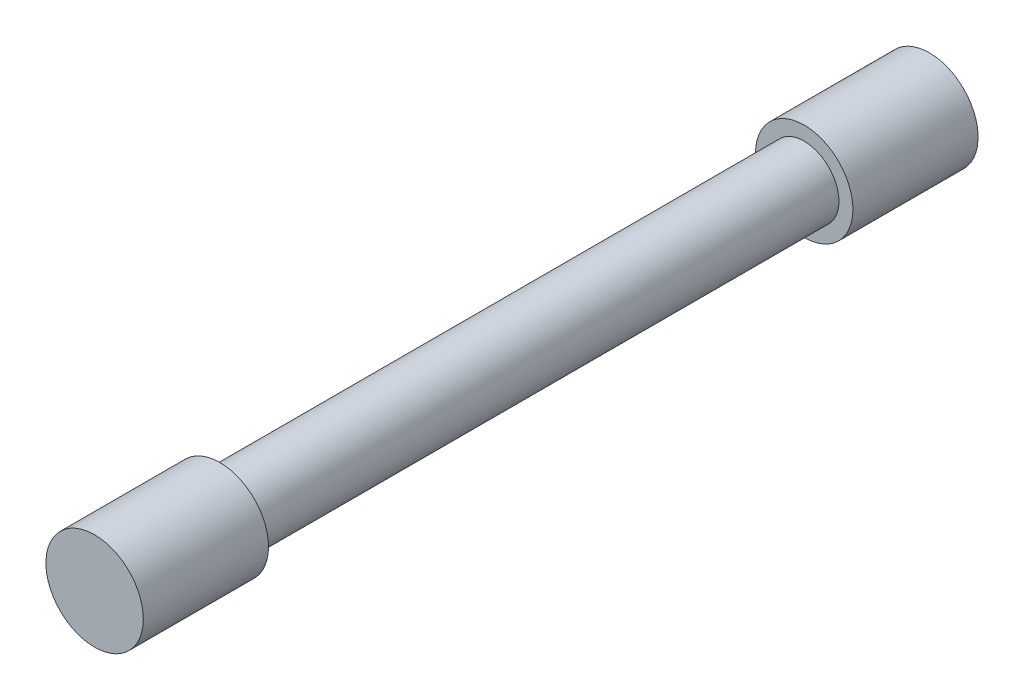
ISO-10303-21;
HEADER;
FILE_DESCRIPTION(('STEP AP214'),'2;1');
FILE_NAME('part.step','',(''),(''),'','','');
FILE_SCHEMA(('AUTOMOTIVE_DESIGN { 1 0 10303 214 1 1 1 1 }'));
ENDSEC;
DATA;
#1=APPLICATION_CONTEXT('core data for automotive mechanical design processes');
#2=APPLICATION_PROTOCOL_DEFINITION('international standard','automotive_design',2000,#1);
#3=PRODUCT_CONTEXT('',#1,'mechanical');
#4=PRODUCT('Part','Part','',(#3));
#5=PRODUCT_RELATED_PRODUCT_CATEGORY('part','',(#4));
#6=PRODUCT_DEFINITION_FORMATION('','',#4);
#7=PRODUCT_DEFINITION_CONTEXT('part definition',#1,'design');
#8=PRODUCT_DEFINITION('design','',#6,#7);
#9=PRODUCT_DEFINITION_SHAPE('','',#8);
#10=(LENGTH_UNIT() NAMED_UNIT(*) SI_UNIT(.MILLI.,.METRE.));
#11=(NAMED_UNIT(*) PLANE_ANGLE_UNIT() SI_UNIT($,.RADIAN.));
#12=(NAMED_UNIT(*) SI_UNIT($,.STERADIAN.) SOLID_ANGLE_UNIT());
#13=UNCERTAINTY_MEASURE_WITH_UNIT(LENGTH_MEASURE(1.E-05),#10,'distance_accuracy_value','');
#14=(GEOMETRIC_REPRESENTATION_CONTEXT(3) GLOBAL_UNCERTAINTY_ASSIGNED_CONTEXT((#13)) GLOBAL_UNIT_ASSIGNED_CONTEXT((#10,
#11,#12)) REPRESENTATION_CONTEXT('',''));
#15=CARTESIAN_POINT('',(0.,0.,0.));
#16=DIRECTION('',(0.,0.,1.));
#17=DIRECTION('',(1.,0.,0.));
#18=AXIS2_PLACEMENT_3D('',#15,#16,#17);
#19=CARTESIAN_POINT('',(0.,0.,18.));
#20=DIRECTION('',(0.,0.,-1.));
#21=DIRECTION('',(-1.,0.,0.));
#22=AXIS2_PLACEMENT_3D('',#19,#20,#21);
#23=CYLINDRICAL_SURFACE('',#22,7.);
#24=CARTESIAN_POINT('',(0.,0.,18.));
#25=DIRECTION('',(0.,0.,1.));
#26=DIRECTION('',(1.,0.,0.));
#27=AXIS2_PLACEMENT_3D('',#24,#25,#26);
#28=CIRCLE('',#27,7.);
#29=CARTESIAN_POINT('',(7.,0.,18.));
#30=VERTEX_POINT('',#29);
#31=EDGE_CURVE('E41',#30,#30,#28,.T.);
#32=ORIENTED_EDGE('',*,*,#31,.F.);
#33=EDGE_LOOP('',(#32));
#34=FACE_BOUND('',#33,.T.);
#35=CARTESIAN_POINT('',(0.,0.,0.));
#36=DIRECTION('',(0.,0.,1.));
#37=DIRECTION('',(1.,0.,0.));
#38=AXIS2_PLACEMENT_3D('',#35,#36,#37);
#39=CIRCLE('',#38,7.);
#40=CARTESIAN_POINT('',(7.,0.,0.));
#41=VERTEX_POINT('',#40);
#42=EDGE_CURVE('E45',#41,#41,#39,.T.);
#43=ORIENTED_EDGE('',*,*,#42,.T.);
#44=EDGE_LOOP('',(#43));
#45=FACE_BOUND('',#44,.T.);
#46=ADVANCED_FACE('F35',(#34,#45),#23,.T.);
#47=CARTESIAN_POINT('',(0.,0.,18.));
#48=DIRECTION('',(0.,0.,1.));
#49=DIRECTION('',(1.,0.,0.));
#50=AXIS2_PLACEMENT_3D('',#47,#48,#49);
#51=PLANE('',#50);
#52=ORIENTED_EDGE('',*,*,#31,.T.);
#53=EDGE_LOOP('',(#52));
#54=FACE_BOUND('',#53,.T.);
#55=ADVANCED_FACE('F79',(#54),#51,.T.);
#56=CARTESIAN_POINT('',(0.,0.,0.));
#57=DIRECTION('',(0.,0.,1.));
#58=DIRECTION('',(1.,0.,0.));
#59=AXIS2_PLACEMENT_3D('',#56,#57,#58);
#60=PLANE('',#59);
#61=CARTESIAN_POINT('',(0.,0.,0.));
#62=DIRECTION('',(0.,0.,1.));
#63=DIRECTION('',(1.,0.,0.));
#64=AXIS2_PLACEMENT_3D('',#61,#62,#63);
#65=CIRCLE('',#64,5.);
#66=CARTESIAN_POINT('',(5.,0.,0.));
#67=VERTEX_POINT('',#66);
#68=EDGE_CURVE('E10',#67,#67,#65,.F.);
#69=ORIENTED_EDGE('',*,*,#68,.F.);
#70=EDGE_LOOP('',(#69));
#71=FACE_BOUND('',#70,.T.);
#72=ORIENTED_EDGE('',*,*,#42,.F.);
#73=EDGE_LOOP('',(#72));
#74=FACE_BOUND('',#73,.T.);
#75=ADVANCED_FACE('F84',(#71,#74),#60,.F.);
#76=CARTESIAN_POINT('',(0.,0.,-84.));
#77=DIRECTION('',(0.,0.,1.));
#78=DIRECTION('',(1.,0.,0.));
#79=AXIS2_PLACEMENT_3D('',#76,#77,#78);
#80=CYLINDRICAL_SURFACE('',#79,5.);
#81=CARTESIAN_POINT('',(0.,0.,-84.));
#82=DIRECTION('',(0.,0.,-1.));
#83=DIRECTION('',(-1.,0.,0.));
#84=AXIS2_PLACEMENT_3D('',#81,#82,#83);
#85=CIRCLE('',#84,5.);
#86=CARTESIAN_POINT('',(-5.,0.,-84.));
#87=VERTEX_POINT('',#86);
#88=EDGE_CURVE('E50',#87,#87,#85,.T.);
#89=ORIENTED_EDGE('',*,*,#88,.F.);
#90=EDGE_LOOP('',(#89));
#91=FACE_BOUND('',#90,.T.);
#92=ORIENTED_EDGE('',*,*,#68,.T.);
#93=EDGE_LOOP('',(#92));
#94=FACE_BOUND('',#93,.T.);
#95=ADVANCED_FACE('F66',(#91,#94),#80,.T.);
#96=CARTESIAN_POINT('',(0.,0.,-102.));
#97=DIRECTION('',(0.,0.,1.));
#98=DIRECTION('',(1.,0.,0.));
#99=AXIS2_PLACEMENT_3D('',#96,#97,#98);
#100=CYLINDRICAL_SURFACE('',#99,7.);
#101=CARTESIAN_POINT('',(0.,0.,-102.));
#102=DIRECTION('',(0.,0.,-1.));
#103=DIRECTION('',(-1.,0.,0.));
#104=AXIS2_PLACEMENT_3D('',#101,#102,#103);
#105=CIRCLE('',#104,7.);
#106=CARTESIAN_POINT('',(-7.,0.,-102.));
#107=VERTEX_POINT('',#106);
#108=EDGE_CURVE('E54',#107,#107,#105,.T.);
#109=ORIENTED_EDGE('',*,*,#108,.F.);
#110=EDGE_LOOP('',(#109));
#111=FACE_BOUND('',#110,.T.);
#112=CARTESIAN_POINT('',(0.,0.,-84.));
#113=DIRECTION('',(0.,0.,-1.));
#114=DIRECTION('',(-1.,0.,0.));
#115=AXIS2_PLACEMENT_3D('',#112,#113,#114);
#116=CIRCLE('',#115,7.);
#117=CARTESIAN_POINT('',(-7.,0.,-84.));
#118=VERTEX_POINT('',#117);
#119=EDGE_CURVE('E55',#118,#118,#116,.T.);
#120=ORIENTED_EDGE('',*,*,#119,.T.);
#121=EDGE_LOOP('',(#120));
#122=FACE_BOUND('',#121,.T.);
#123=ADVANCED_FACE('F63',(#111,#122),#100,.T.);
#124=CARTESIAN_POINT('',(0.,0.,-102.));
#125=DIRECTION('',(0.,0.,-1.));
#126=DIRECTION('',(-1.,0.,0.));
#127=AXIS2_PLACEMENT_3D('',#124,#125,#126);
#128=PLANE('',#127);
#129=ORIENTED_EDGE('',*,*,#108,.T.);
#130=EDGE_LOOP('',(#129));
#131=FACE_BOUND('',#130,.T.);
#132=ADVANCED_FACE('F61',(#131),#128,.T.);
#133=CARTESIAN_POINT('',(0.,0.,-84.));
#134=DIRECTION('',(0.,0.,-1.));
#135=DIRECTION('',(-1.,0.,0.));
#136=AXIS2_PLACEMENT_3D('',#133,#134,#135);
#137=PLANE('',#136);
#138=ORIENTED_EDGE('',*,*,#88,.T.);
#139=EDGE_LOOP('',(#138));
#140=FACE_BOUND('',#139,.T.);
#141=ORIENTED_EDGE('',*,*,#119,.F.);
#142=EDGE_LOOP('',(#141));
#143=FACE_BOUND('',#142,.T.);
#144=ADVANCED_FACE('F70',(#140,#143),#137,.F.);
#145=CLOSED_SHELL('',(#46,#55,#75,#95,#123,#132,#144));
#146=MANIFOLD_SOLID_BREP('B2',#145);
#147=ADVANCED_BREP_SHAPE_REPRESENTATION('',(#18,#146),#14);
#148=SHAPE_DEFINITION_REPRESENTATION(#9,#147);
ENDSEC;
END-ISO-10303-21;
